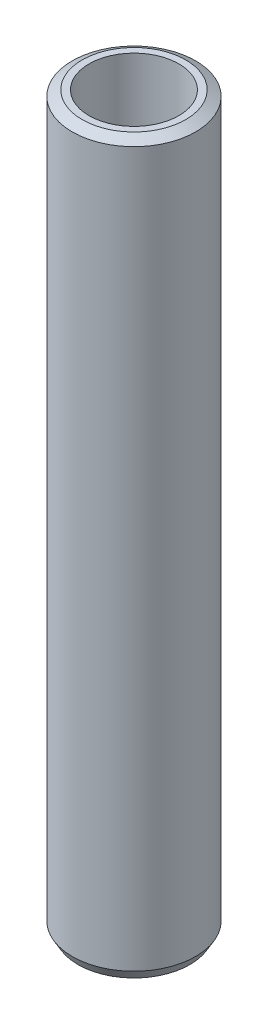
ISO-10303-21;
HEADER;
FILE_DESCRIPTION(('STEP AP214'),'2;1');
FILE_NAME('part.step','',(''),(''),'','','');
FILE_SCHEMA(('AUTOMOTIVE_DESIGN { 1 0 10303 214 1 1 1 1 }'));
ENDSEC;
DATA;
#1=APPLICATION_CONTEXT('core data for automotive mechanical design processes');
#2=APPLICATION_PROTOCOL_DEFINITION('international standard','automotive_design',2000,#1);
#3=PRODUCT_CONTEXT('',#1,'mechanical');
#4=PRODUCT('Part','Part','',(#3));
#5=PRODUCT_RELATED_PRODUCT_CATEGORY('part','',(#4));
#6=PRODUCT_DEFINITION_FORMATION('','',#4);
#7=PRODUCT_DEFINITION_CONTEXT('part definition',#1,'design');
#8=PRODUCT_DEFINITION('design','',#6,#7);
#9=PRODUCT_DEFINITION_SHAPE('','',#8);
#10=(LENGTH_UNIT() NAMED_UNIT(*) SI_UNIT(.MILLI.,.METRE.));
#11=(NAMED_UNIT(*) PLANE_ANGLE_UNIT() SI_UNIT($,.RADIAN.));
#12=(NAMED_UNIT(*) SI_UNIT($,.STERADIAN.) SOLID_ANGLE_UNIT());
#13=UNCERTAINTY_MEASURE_WITH_UNIT(LENGTH_MEASURE(1.E-05),#10,'distance_accuracy_value','');
#14=(GEOMETRIC_REPRESENTATION_CONTEXT(3) GLOBAL_UNCERTAINTY_ASSIGNED_CONTEXT((#13)) GLOBAL_UNIT_ASSIGNED_CONTEXT((#10,
#11,#12)) REPRESENTATION_CONTEXT('',''));
#15=CARTESIAN_POINT('',(0.,0.,0.));
#16=DIRECTION('',(0.,0.,1.));
#17=DIRECTION('',(1.,0.,0.));
#18=AXIS2_PLACEMENT_3D('',#15,#16,#17);
#19=CARTESIAN_POINT('',(0.,591.661672504013,0.));
#20=DIRECTION('',(0.,-1.,0.));
#21=DIRECTION('',(0.,0.,-1.));
#22=AXIS2_PLACEMENT_3D('',#19,#20,#21);
#23=CYLINDRICAL_SURFACE('',#22,50.);
#24=CARTESIAN_POINT('',(0.,587.032971334801,0.));
#25=DIRECTION('',(0.,1.,0.));
#26=DIRECTION('',(0.,0.,1.));
#27=AXIS2_PLACEMENT_3D('',#24,#25,#26);
#28=CIRCLE('',#27,50.);
#29=CARTESIAN_POINT('',(0.,587.032971334801,50.));
#30=VERTEX_POINT('',#29);
#31=EDGE_CURVE('E50',#30,#30,#28,.F.);
#32=ORIENTED_EDGE('',*,*,#31,.T.);
#33=EDGE_LOOP('',(#32));
#34=FACE_BOUND('',#33,.T.);
#35=CARTESIAN_POINT('',(0.,8.01714559812849,0.));
#36=DIRECTION('',(0.,1.,0.));
#37=DIRECTION('',(0.,0.,1.));
#38=AXIS2_PLACEMENT_3D('',#35,#36,#37);
#39=CIRCLE('',#38,50.);
#40=CARTESIAN_POINT('',(0.,8.01714559812849,50.));
#41=VERTEX_POINT('',#40);
#42=EDGE_CURVE('E51',#41,#41,#39,.T.);
#43=ORIENTED_EDGE('',*,*,#42,.T.);
#44=EDGE_LOOP('',(#43));
#45=FACE_BOUND('',#44,.T.);
#46=ADVANCED_FACE('F39',(#34,#45),#23,.T.);
#47=CARTESIAN_POINT('',(0.,591.661672504013,0.));
#48=DIRECTION('',(0.,1.,0.));
#49=DIRECTION('',(0.,0.,1.));
#50=AXIS2_PLACEMENT_3D('',#47,#48,#49);
#51=PLANE('',#50);
#52=CARTESIAN_POINT('',(0.,591.661672504013,0.));
#53=DIRECTION('',(0.,1.,0.));
#54=DIRECTION('',(0.,0.,1.));
#55=AXIS2_PLACEMENT_3D('',#52,#53,#54);
#56=CIRCLE('',#55,41.9828544018715);
#57=CARTESIAN_POINT('',(0.,591.661672504013,41.9828544018715));
#58=VERTEX_POINT('',#57);
#59=EDGE_CURVE('E54',#58,#58,#56,.T.);
#60=ORIENTED_EDGE('',*,*,#59,.T.);
#61=EDGE_LOOP('',(#60));
#62=FACE_BOUND('',#61,.T.);
#63=CARTESIAN_POINT('',(0.,591.661672504013,0.));
#64=DIRECTION('',(0.,1.,0.));
#65=DIRECTION('',(0.,0.,1.));
#66=AXIS2_PLACEMENT_3D('',#63,#64,#65);
#67=CIRCLE('',#66,36.4171316009978);
#68=CARTESIAN_POINT('',(0.,591.661672504013,36.4171316009978));
#69=VERTEX_POINT('',#68);
#70=EDGE_CURVE('E58',#69,#69,#67,.T.);
#71=ORIENTED_EDGE('',*,*,#70,.F.);
#72=EDGE_LOOP('',(#71));
#73=FACE_BOUND('',#72,.T.);
#74=ADVANCED_FACE('F69',(#62,#73),#51,.T.);
#75=CARTESIAN_POINT('',(0.,0.,0.));
#76=DIRECTION('',(0.,1.,0.));
#77=DIRECTION('',(0.,0.,1.));
#78=AXIS2_PLACEMENT_3D('',#75,#76,#77);
#79=PLANE('',#78);
#80=CARTESIAN_POINT('',(0.,0.,0.));
#81=DIRECTION('',(0.,1.,0.));
#82=DIRECTION('',(0.,0.,1.));
#83=AXIS2_PLACEMENT_3D('',#80,#81,#82);
#84=CIRCLE('',#83,45.3712988307881);
#85=CARTESIAN_POINT('',(0.,0.,45.3712988307881));
#86=VERTEX_POINT('',#85);
#87=EDGE_CURVE('E10',#86,#86,#84,.F.);
#88=ORIENTED_EDGE('',*,*,#87,.T.);
#89=EDGE_LOOP('',(#88));
#90=FACE_BOUND('',#89,.T.);
#91=CARTESIAN_POINT('',(0.,0.,0.));
#92=DIRECTION('',(0.,1.,0.));
#93=DIRECTION('',(0.,0.,1.));
#94=AXIS2_PLACEMENT_3D('',#91,#92,#93);
#95=CIRCLE('',#94,36.4171316009978);
#96=CARTESIAN_POINT('',(0.,0.,36.4171316009978));
#97=VERTEX_POINT('',#96);
#98=EDGE_CURVE('E63',#97,#97,#95,.T.);
#99=ORIENTED_EDGE('',*,*,#98,.T.);
#100=EDGE_LOOP('',(#99));
#101=FACE_BOUND('',#100,.T.);
#102=ADVANCED_FACE('F75',(#90,#101),#79,.F.);
#103=CARTESIAN_POINT('',(0.,591.661672504013,0.));
#104=DIRECTION('',(0.,-1.,0.));
#105=DIRECTION('',(0.,0.,-1.));
#106=AXIS2_PLACEMENT_3D('',#103,#104,#105);
#107=CYLINDRICAL_SURFACE('',#106,36.4171316009978);
#108=ORIENTED_EDGE('',*,*,#70,.T.);
#109=EDGE_LOOP('',(#108));
#110=FACE_BOUND('',#109,.T.);
#111=ORIENTED_EDGE('',*,*,#98,.F.);
#112=EDGE_LOOP('',(#111));
#113=FACE_BOUND('',#112,.T.);
#114=ADVANCED_FACE('F70',(#110,#113),#107,.F.);
#115=CARTESIAN_POINT('',(0.,591.661672504013,0.));
#116=DIRECTION('',(0.,-1.,0.));
#117=DIRECTION('',(0.,0.,-1.));
#118=AXIS2_PLACEMENT_3D('',#115,#116,#117);
#119=CONICAL_SURFACE('',#118,41.9828544018715,1.0471975511966);
#120=ORIENTED_EDGE('',*,*,#31,.F.);
#121=EDGE_LOOP('',(#120));
#122=FACE_BOUND('',#121,.T.);
#123=ORIENTED_EDGE('',*,*,#59,.F.);
#124=EDGE_LOOP('',(#123));
#125=FACE_BOUND('',#124,.T.);
#126=ADVANCED_FACE('F81',(#122,#125),#119,.T.);
#127=CARTESIAN_POINT('',(0.,8.01714559812849,0.));
#128=DIRECTION('',(0.,1.,0.));
#129=DIRECTION('',(0.,0.,1.));
#130=AXIS2_PLACEMENT_3D('',#127,#128,#129);
#131=CONICAL_SURFACE('',#130,50.,0.523598775598303);
#132=ORIENTED_EDGE('',*,*,#87,.F.);
#133=EDGE_LOOP('',(#132));
#134=FACE_BOUND('',#133,.T.);
#135=ORIENTED_EDGE('',*,*,#42,.F.);
#136=EDGE_LOOP('',(#135));
#137=FACE_BOUND('',#136,.T.);
#138=ADVANCED_FACE('F45',(#134,#137),#131,.T.);
#139=CLOSED_SHELL('',(#46,#74,#102,#114,#126,#138));
#140=MANIFOLD_SOLID_BREP('B2',#139);
#141=ADVANCED_BREP_SHAPE_REPRESENTATION('',(#18,#140),#14);
#142=SHAPE_DEFINITION_REPRESENTATION(#9,#141);
ENDSEC;
END-ISO-10303-21;
